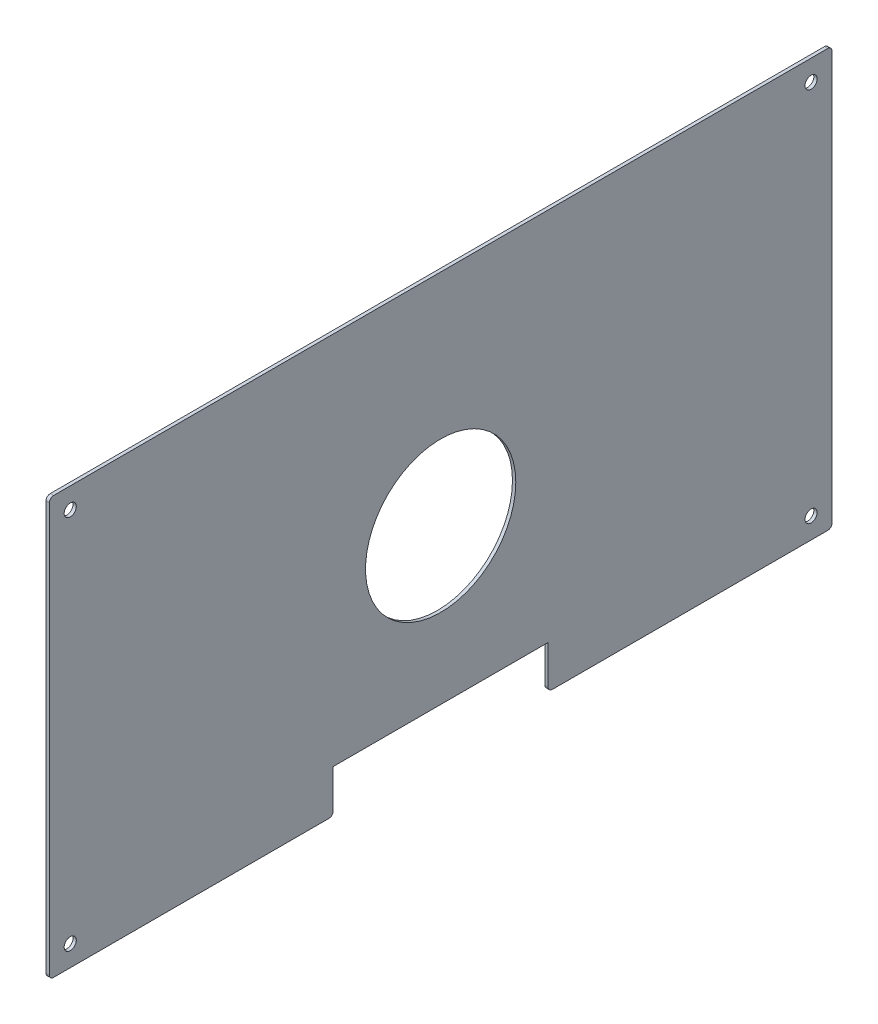
ISO-10303-21;
HEADER;
FILE_DESCRIPTION(('STEP AP214'),'2;1');
FILE_NAME('part.step','',(''),(''),'','','');
FILE_SCHEMA(('AUTOMOTIVE_DESIGN { 1 0 10303 214 1 1 1 1 }'));
ENDSEC;
DATA;
#1=APPLICATION_CONTEXT('core data for automotive mechanical design processes');
#2=APPLICATION_PROTOCOL_DEFINITION('international standard','automotive_design',2000,#1);
#3=PRODUCT_CONTEXT('',#1,'mechanical');
#4=PRODUCT('Part','Part','',(#3));
#5=PRODUCT_RELATED_PRODUCT_CATEGORY('part','',(#4));
#6=PRODUCT_DEFINITION_FORMATION('','',#4);
#7=PRODUCT_DEFINITION_CONTEXT('part definition',#1,'design');
#8=PRODUCT_DEFINITION('design','',#6,#7);
#9=PRODUCT_DEFINITION_SHAPE('','',#8);
#10=(LENGTH_UNIT() NAMED_UNIT(*) SI_UNIT(.MILLI.,.METRE.));
#11=(NAMED_UNIT(*) PLANE_ANGLE_UNIT() SI_UNIT($,.RADIAN.));
#12=(NAMED_UNIT(*) SI_UNIT($,.STERADIAN.) SOLID_ANGLE_UNIT());
#13=UNCERTAINTY_MEASURE_WITH_UNIT(LENGTH_MEASURE(1.E-05),#10,'distance_accuracy_value','');
#14=(GEOMETRIC_REPRESENTATION_CONTEXT(3) GLOBAL_UNCERTAINTY_ASSIGNED_CONTEXT((#13)) GLOBAL_UNIT_ASSIGNED_CONTEXT((#10,
#11,#12)) REPRESENTATION_CONTEXT('',''));
#15=CARTESIAN_POINT('',(0.,0.,0.));
#16=DIRECTION('',(0.,0.,1.));
#17=DIRECTION('',(1.,0.,0.));
#18=AXIS2_PLACEMENT_3D('',#15,#16,#17);
#19=CARTESIAN_POINT('',(-1.5875,-100.,187.5));
#20=DIRECTION('',(0.,-1.,0.));
#21=DIRECTION('',(0.,0.,-1.));
#22=AXIS2_PLACEMENT_3D('',#19,#20,#21);
#23=PLANE('',#22);
#24=DIRECTION('',(0.,0.,-1.));
#25=VECTOR('',#24,1.);
#26=CARTESIAN_POINT('',(-1.5875,-100.,187.5));
#27=LINE('',#26,#25);
#28=CARTESIAN_POINT('',(-1.5875,-100.,185.5));
#29=VERTEX_POINT('',#28);
#30=CARTESIAN_POINT('',(-1.5875,-100.,53.5));
#31=VERTEX_POINT('',#30);
#32=EDGE_CURVE('E203',#29,#31,#27,.T.);
#33=ORIENTED_EDGE('',*,*,#32,.T.);
#34=DIRECTION('',(1.,0.,0.));
#35=VECTOR('',#34,1.);
#36=CARTESIAN_POINT('',(0.,-100.,53.5));
#37=LINE('',#36,#35);
#38=CARTESIAN_POINT('',(0.,-100.,53.5));
#39=VERTEX_POINT('',#38);
#40=EDGE_CURVE('E260',#31,#39,#37,.T.);
#41=ORIENTED_EDGE('',*,*,#40,.T.);
#42=DIRECTION('',(0.,0.,-1.));
#43=VECTOR('',#42,1.);
#44=CARTESIAN_POINT('',(0.,-100.,187.5));
#45=LINE('',#44,#43);
#46=CARTESIAN_POINT('',(0.,-100.,185.5));
#47=VERTEX_POINT('',#46);
#48=EDGE_CURVE('E196',#47,#39,#45,.T.);
#49=ORIENTED_EDGE('',*,*,#48,.F.);
#50=DIRECTION('',(1.,0.,0.));
#51=VECTOR('',#50,1.);
#52=CARTESIAN_POINT('',(-1.5875,-100.,185.5));
#53=LINE('',#52,#51);
#54=EDGE_CURVE('E249',#47,#29,#53,.F.);
#55=ORIENTED_EDGE('',*,*,#54,.T.);
#56=EDGE_LOOP('',(#33,#41,#49,#55));
#57=FACE_BOUND('',#56,.T.);
#58=ADVANCED_FACE('F36',(#57),#23,.T.);
#59=CARTESIAN_POINT('',(-1.5875,-100.,-187.5));
#60=DIRECTION('',(0.,0.,-1.));
#61=DIRECTION('',(-1.,0.,0.));
#62=AXIS2_PLACEMENT_3D('',#59,#60,#61);
#63=PLANE('',#62);
#64=DIRECTION('',(0.,1.,0.));
#65=VECTOR('',#64,1.);
#66=CARTESIAN_POINT('',(-1.5875,-100.,-187.5));
#67=LINE('',#66,#65);
#68=CARTESIAN_POINT('',(-1.5875,-98.,-187.5));
#69=VERTEX_POINT('',#68);
#70=CARTESIAN_POINT('',(-1.5875,98.,-187.5));
#71=VERTEX_POINT('',#70);
#72=EDGE_CURVE('E192',#69,#71,#67,.T.);
#73=ORIENTED_EDGE('',*,*,#72,.T.);
#74=DIRECTION('',(1.,0.,0.));
#75=VECTOR('',#74,1.);
#76=CARTESIAN_POINT('',(-1.5875,98.,-187.5));
#77=LINE('',#76,#75);
#78=CARTESIAN_POINT('',(0.,98.,-187.5));
#79=VERTEX_POINT('',#78);
#80=EDGE_CURVE('E226',#71,#79,#77,.T.);
#81=ORIENTED_EDGE('',*,*,#80,.T.);
#82=DIRECTION('',(0.,1.,0.));
#83=VECTOR('',#82,1.);
#84=CARTESIAN_POINT('',(0.,-100.,-187.5));
#85=LINE('',#84,#83);
#86=CARTESIAN_POINT('',(0.,-98.,-187.5));
#87=VERTEX_POINT('',#86);
#88=EDGE_CURVE('E191',#87,#79,#85,.T.);
#89=ORIENTED_EDGE('',*,*,#88,.F.);
#90=DIRECTION('',(1.,0.,0.));
#91=VECTOR('',#90,1.);
#92=CARTESIAN_POINT('',(-1.5875,-98.,-187.5));
#93=LINE('',#92,#91);
#94=EDGE_CURVE('E221',#87,#69,#93,.F.);
#95=ORIENTED_EDGE('',*,*,#94,.T.);
#96=EDGE_LOOP('',(#73,#81,#89,#95));
#97=FACE_BOUND('',#96,.T.);
#98=ADVANCED_FACE('F297',(#97),#63,.T.);
#99=CARTESIAN_POINT('',(0.,-100.,-53.5));
#100=VERTEX_POINT('',#99);
#101=CARTESIAN_POINT('',(0.,-100.,-185.5));
#102=VERTEX_POINT('',#101);
#103=EDGE_CURVE('E215',#100,#102,#45,.T.);
#104=ORIENTED_EDGE('',*,*,#103,.F.);
#105=DIRECTION('',(1.,0.,0.));
#106=VECTOR('',#105,1.);
#107=CARTESIAN_POINT('',(-1.5875,-100.,-53.5));
#108=LINE('',#107,#106);
#109=CARTESIAN_POINT('',(-1.5875,-100.,-53.5));
#110=VERTEX_POINT('',#109);
#111=EDGE_CURVE('E256',#100,#110,#108,.F.);
#112=ORIENTED_EDGE('',*,*,#111,.T.);
#113=CARTESIAN_POINT('',(-1.5875,-100.,-185.5));
#114=VERTEX_POINT('',#113);
#115=EDGE_CURVE('E202',#110,#114,#27,.T.);
#116=ORIENTED_EDGE('',*,*,#115,.T.);
#117=DIRECTION('',(1.,0.,0.));
#118=VECTOR('',#117,1.);
#119=CARTESIAN_POINT('',(-1.5875,-100.,-185.5));
#120=LINE('',#119,#118);
#121=EDGE_CURVE('E206',#114,#102,#120,.T.);
#122=ORIENTED_EDGE('',*,*,#121,.T.);
#123=EDGE_LOOP('',(#104,#112,#116,#122));
#124=FACE_BOUND('',#123,.T.);
#125=ADVANCED_FACE('F308',(#124),#23,.T.);
#126=CARTESIAN_POINT('',(-1.5875,-100.,187.5));
#127=DIRECTION('',(0.,0.,1.));
#128=DIRECTION('',(1.,0.,0.));
#129=AXIS2_PLACEMENT_3D('',#126,#127,#128);
#130=PLANE('',#129);
#131=DIRECTION('',(0.,-1.,0.));
#132=VECTOR('',#131,1.);
#133=CARTESIAN_POINT('',(-1.5875,-100.,187.5));
#134=LINE('',#133,#132);
#135=CARTESIAN_POINT('',(-1.5875,98.,187.5));
#136=VERTEX_POINT('',#135);
#137=CARTESIAN_POINT('',(-1.5875,-98.,187.5));
#138=VERTEX_POINT('',#137);
#139=EDGE_CURVE('E199',#136,#138,#134,.T.);
#140=ORIENTED_EDGE('',*,*,#139,.T.);
#141=DIRECTION('',(1.,0.,0.));
#142=VECTOR('',#141,1.);
#143=CARTESIAN_POINT('',(-1.5875,-98.,187.5));
#144=LINE('',#143,#142);
#145=CARTESIAN_POINT('',(0.,-98.,187.5));
#146=VERTEX_POINT('',#145);
#147=EDGE_CURVE('E244',#138,#146,#144,.T.);
#148=ORIENTED_EDGE('',*,*,#147,.T.);
#149=DIRECTION('',(0.,-1.,0.));
#150=VECTOR('',#149,1.);
#151=CARTESIAN_POINT('',(0.,-100.,187.5));
#152=LINE('',#151,#150);
#153=CARTESIAN_POINT('',(0.,98.,187.5));
#154=VERTEX_POINT('',#153);
#155=EDGE_CURVE('E212',#154,#146,#152,.T.);
#156=ORIENTED_EDGE('',*,*,#155,.F.);
#157=DIRECTION('',(1.,0.,0.));
#158=VECTOR('',#157,1.);
#159=CARTESIAN_POINT('',(-1.5875,98.,187.5));
#160=LINE('',#159,#158);
#161=EDGE_CURVE('E240',#154,#136,#160,.F.);
#162=ORIENTED_EDGE('',*,*,#161,.T.);
#163=EDGE_LOOP('',(#140,#148,#156,#162));
#164=FACE_BOUND('',#163,.T.);
#165=ADVANCED_FACE('F276',(#164),#130,.T.);
#166=CARTESIAN_POINT('',(-1.5875,100.,187.5));
#167=DIRECTION('',(0.,1.,0.));
#168=DIRECTION('',(0.,0.,1.));
#169=AXIS2_PLACEMENT_3D('',#166,#167,#168);
#170=PLANE('',#169);
#171=DIRECTION('',(0.,0.,1.));
#172=VECTOR('',#171,1.);
#173=CARTESIAN_POINT('',(-1.5875,100.,187.5));
#174=LINE('',#173,#172);
#175=CARTESIAN_POINT('',(-1.5875,100.,-185.5));
#176=VERTEX_POINT('',#175);
#177=CARTESIAN_POINT('',(-1.5875,100.,185.5));
#178=VERTEX_POINT('',#177);
#179=EDGE_CURVE('E195',#176,#178,#174,.T.);
#180=ORIENTED_EDGE('',*,*,#179,.T.);
#181=DIRECTION('',(1.,0.,0.));
#182=VECTOR('',#181,1.);
#183=CARTESIAN_POINT('',(-1.5875,100.,185.5));
#184=LINE('',#183,#182);
#185=CARTESIAN_POINT('',(0.,100.,185.5));
#186=VERTEX_POINT('',#185);
#187=EDGE_CURVE('E235',#178,#186,#184,.T.);
#188=ORIENTED_EDGE('',*,*,#187,.T.);
#189=DIRECTION('',(0.,0.,1.));
#190=VECTOR('',#189,1.);
#191=CARTESIAN_POINT('',(0.,100.,187.5));
#192=LINE('',#191,#190);
#193=CARTESIAN_POINT('',(0.,100.,-185.5));
#194=VERTEX_POINT('',#193);
#195=EDGE_CURVE('E209',#194,#186,#192,.T.);
#196=ORIENTED_EDGE('',*,*,#195,.F.);
#197=DIRECTION('',(1.,0.,0.));
#198=VECTOR('',#197,1.);
#199=CARTESIAN_POINT('',(-1.5875,100.,-185.5));
#200=LINE('',#199,#198);
#201=EDGE_CURVE('E231',#194,#176,#200,.F.);
#202=ORIENTED_EDGE('',*,*,#201,.T.);
#203=EDGE_LOOP('',(#180,#188,#196,#202));
#204=FACE_BOUND('',#203,.T.);
#205=ADVANCED_FACE('F289',(#204),#170,.T.);
#206=CARTESIAN_POINT('',(-1.5875,0.,0.));
#207=DIRECTION('',(-1.,0.,0.));
#208=DIRECTION('',(0.,0.,1.));
#209=AXIS2_PLACEMENT_3D('',#206,#207,#208);
#210=PLANE('',#209);
#211=CARTESIAN_POINT('',(-1.5875,-5.28,0.));
#212=DIRECTION('',(-1.,0.,0.));
#213=DIRECTION('',(0.,0.,1.));
#214=AXIS2_PLACEMENT_3D('',#211,#212,#213);
#215=CIRCLE('',#214,36.);
#216=CARTESIAN_POINT('',(-1.5875,-5.28,36.));
#217=VERTEX_POINT('',#216);
#218=EDGE_CURVE('E399',#217,#217,#215,.T.);
#219=ORIENTED_EDGE('',*,*,#218,.F.);
#220=EDGE_LOOP('',(#219));
#221=FACE_BOUND('',#220,.T.);
#222=DIRECTION('',(0.,1.,0.));
#223=VECTOR('',#222,1.);
#224=CARTESIAN_POINT('',(-1.5875,0.,51.5));
#225=LINE('',#224,#223);
#226=CARTESIAN_POINT('',(-1.5875,-98.,51.5));
#227=VERTEX_POINT('',#226);
#228=CARTESIAN_POINT('',(-1.5875,-79.5,51.5));
#229=VERTEX_POINT('',#228);
#230=EDGE_CURVE('E165',#227,#229,#225,.T.);
#231=ORIENTED_EDGE('',*,*,#230,.F.);
#232=CARTESIAN_POINT('',(-1.5875,-98.,53.5));
#233=DIRECTION('',(-1.,0.,0.));
#234=DIRECTION('',(0.,0.,1.));
#235=AXIS2_PLACEMENT_3D('',#232,#233,#234);
#236=CIRCLE('',#235,2.);
#237=EDGE_CURVE('E11',#227,#31,#236,.T.);
#238=ORIENTED_EDGE('',*,*,#237,.T.);
#239=ORIENTED_EDGE('',*,*,#32,.F.);
#240=CARTESIAN_POINT('',(-1.5875,-98.,185.5));
#241=DIRECTION('',(-1.,0.,0.));
#242=DIRECTION('',(0.,0.,1.));
#243=AXIS2_PLACEMENT_3D('',#240,#241,#242);
#244=CIRCLE('',#243,2.);
#245=EDGE_CURVE('E251',#29,#138,#244,.T.);
#246=ORIENTED_EDGE('',*,*,#245,.T.);
#247=ORIENTED_EDGE('',*,*,#139,.F.);
#248=CARTESIAN_POINT('',(-1.5875,98.,185.5));
#249=DIRECTION('',(-1.,0.,0.));
#250=DIRECTION('',(0.,0.,1.));
#251=AXIS2_PLACEMENT_3D('',#248,#249,#250);
#252=CIRCLE('',#251,2.);
#253=EDGE_CURVE('E242',#136,#178,#252,.T.);
#254=ORIENTED_EDGE('',*,*,#253,.T.);
#255=ORIENTED_EDGE('',*,*,#179,.F.);
#256=CARTESIAN_POINT('',(-1.5875,98.,-185.5));
#257=DIRECTION('',(-1.,0.,0.));
#258=DIRECTION('',(0.,0.,1.));
#259=AXIS2_PLACEMENT_3D('',#256,#257,#258);
#260=CIRCLE('',#259,2.);
#261=EDGE_CURVE('E233',#176,#71,#260,.T.);
#262=ORIENTED_EDGE('',*,*,#261,.T.);
#263=ORIENTED_EDGE('',*,*,#72,.F.);
#264=CARTESIAN_POINT('',(-1.5875,-98.,-185.5));
#265=DIRECTION('',(-1.,0.,0.));
#266=DIRECTION('',(0.,0.,1.));
#267=AXIS2_PLACEMENT_3D('',#264,#265,#266);
#268=CIRCLE('',#267,2.);
#269=EDGE_CURVE('E223',#69,#114,#268,.T.);
#270=ORIENTED_EDGE('',*,*,#269,.T.);
#271=ORIENTED_EDGE('',*,*,#115,.F.);
#272=CARTESIAN_POINT('',(-1.5875,-98.,-53.5));
#273=DIRECTION('',(-1.,0.,0.));
#274=DIRECTION('',(0.,0.,1.));
#275=AXIS2_PLACEMENT_3D('',#272,#273,#274);
#276=CIRCLE('',#275,2.);
#277=CARTESIAN_POINT('',(-1.5875,-98.,-51.5));
#278=VERTEX_POINT('',#277);
#279=EDGE_CURVE('E258',#110,#278,#276,.T.);
#280=ORIENTED_EDGE('',*,*,#279,.T.);
#281=DIRECTION('',(0.,-1.,0.));
#282=VECTOR('',#281,1.);
#283=CARTESIAN_POINT('',(-1.5875,0.,-51.5));
#284=LINE('',#283,#282);
#285=CARTESIAN_POINT('',(-1.5875,-79.5,-51.5));
#286=VERTEX_POINT('',#285);
#287=EDGE_CURVE('E161',#286,#278,#284,.T.);
#288=ORIENTED_EDGE('',*,*,#287,.F.);
#289=DIRECTION('',(0.,0.,-1.));
#290=VECTOR('',#289,1.);
#291=CARTESIAN_POINT('',(-1.5875,-79.5,0.));
#292=LINE('',#291,#290);
#293=EDGE_CURVE('E154',#229,#286,#292,.T.);
#294=ORIENTED_EDGE('',*,*,#293,.F.);
#295=EDGE_LOOP('',(#231,#238,#239,#246,#247,#254,#255,#262,#263,#270,#271,#280,#288,#294));
#296=FACE_BOUND('',#295,.T.);
#297=CARTESIAN_POINT('',(-1.5875,-90.,177.5));
#298=DIRECTION('',(-1.,0.,0.));
#299=DIRECTION('',(0.,0.,1.));
#300=AXIS2_PLACEMENT_3D('',#297,#298,#299);
#301=CIRCLE('',#300,2.9);
#302=CARTESIAN_POINT('',(-1.5875,-90.,180.4));
#303=VERTEX_POINT('',#302);
#304=EDGE_CURVE('E167',#303,#303,#301,.T.);
#305=ORIENTED_EDGE('',*,*,#304,.F.);
#306=EDGE_LOOP('',(#305));
#307=FACE_BOUND('',#306,.T.);
#308=CARTESIAN_POINT('',(-1.5875,-90.,-177.5));
#309=DIRECTION('',(-1.,0.,0.));
#310=DIRECTION('',(0.,0.,1.));
#311=AXIS2_PLACEMENT_3D('',#308,#309,#310);
#312=CIRCLE('',#311,2.9);
#313=CARTESIAN_POINT('',(-1.5875,-90.,-174.6));
#314=VERTEX_POINT('',#313);
#315=EDGE_CURVE('E173',#314,#314,#312,.T.);
#316=ORIENTED_EDGE('',*,*,#315,.F.);
#317=EDGE_LOOP('',(#316));
#318=FACE_BOUND('',#317,.T.);
#319=CARTESIAN_POINT('',(-1.5875,90.,-177.5));
#320=DIRECTION('',(-1.,0.,0.));
#321=DIRECTION('',(0.,0.,1.));
#322=AXIS2_PLACEMENT_3D('',#319,#320,#321);
#323=CIRCLE('',#322,2.9);
#324=CARTESIAN_POINT('',(-1.5875,90.,-174.6));
#325=VERTEX_POINT('',#324);
#326=EDGE_CURVE('E179',#325,#325,#323,.T.);
#327=ORIENTED_EDGE('',*,*,#326,.F.);
#328=EDGE_LOOP('',(#327));
#329=FACE_BOUND('',#328,.T.);
#330=CARTESIAN_POINT('',(-1.5875,90.,177.5));
#331=DIRECTION('',(-1.,0.,0.));
#332=DIRECTION('',(0.,0.,1.));
#333=AXIS2_PLACEMENT_3D('',#330,#331,#332);
#334=CIRCLE('',#333,2.9);
#335=CARTESIAN_POINT('',(-1.5875,90.,180.4));
#336=VERTEX_POINT('',#335);
#337=EDGE_CURVE('E185',#336,#336,#334,.T.);
#338=ORIENTED_EDGE('',*,*,#337,.F.);
#339=EDGE_LOOP('',(#338));
#340=FACE_BOUND('',#339,.T.);
#341=ADVANCED_FACE('F281',(#221,#296,#307,#318,#329,#340),#210,.T.);
#342=CARTESIAN_POINT('',(0.,0.,0.));
#343=DIRECTION('',(-1.,0.,0.));
#344=DIRECTION('',(0.,0.,1.));
#345=AXIS2_PLACEMENT_3D('',#342,#343,#344);
#346=PLANE('',#345);
#347=CARTESIAN_POINT('',(0.,-5.28,0.));
#348=DIRECTION('',(1.,0.,0.));
#349=DIRECTION('',(0.,0.,-1.));
#350=AXIS2_PLACEMENT_3D('',#347,#348,#349);
#351=CIRCLE('',#350,36.);
#352=CARTESIAN_POINT('',(0.,-5.28,-36.));
#353=VERTEX_POINT('',#352);
#354=EDGE_CURVE('E379',#353,#353,#351,.T.);
#355=ORIENTED_EDGE('',*,*,#354,.F.);
#356=EDGE_LOOP('',(#355));
#357=FACE_BOUND('',#356,.T.);
#358=CARTESIAN_POINT('',(0.,-90.,177.5));
#359=DIRECTION('',(-1.,0.,0.));
#360=DIRECTION('',(0.,0.,1.));
#361=AXIS2_PLACEMENT_3D('',#358,#359,#360);
#362=CIRCLE('',#361,2.9);
#363=CARTESIAN_POINT('',(0.,-90.,180.4));
#364=VERTEX_POINT('',#363);
#365=EDGE_CURVE('E170',#364,#364,#362,.T.);
#366=ORIENTED_EDGE('',*,*,#365,.T.);
#367=EDGE_LOOP('',(#366));
#368=FACE_BOUND('',#367,.T.);
#369=CARTESIAN_POINT('',(0.,-90.,-177.5));
#370=DIRECTION('',(-1.,0.,0.));
#371=DIRECTION('',(0.,0.,1.));
#372=AXIS2_PLACEMENT_3D('',#369,#370,#371);
#373=CIRCLE('',#372,2.9);
#374=CARTESIAN_POINT('',(0.,-90.,-174.6));
#375=VERTEX_POINT('',#374);
#376=EDGE_CURVE('E176',#375,#375,#373,.T.);
#377=ORIENTED_EDGE('',*,*,#376,.T.);
#378=EDGE_LOOP('',(#377));
#379=FACE_BOUND('',#378,.T.);
#380=CARTESIAN_POINT('',(0.,90.,-177.5));
#381=DIRECTION('',(-1.,0.,0.));
#382=DIRECTION('',(0.,0.,1.));
#383=AXIS2_PLACEMENT_3D('',#380,#381,#382);
#384=CIRCLE('',#383,2.9);
#385=CARTESIAN_POINT('',(0.,90.,-174.6));
#386=VERTEX_POINT('',#385);
#387=EDGE_CURVE('E182',#386,#386,#384,.T.);
#388=ORIENTED_EDGE('',*,*,#387,.T.);
#389=EDGE_LOOP('',(#388));
#390=FACE_BOUND('',#389,.T.);
#391=CARTESIAN_POINT('',(0.,90.,177.5));
#392=DIRECTION('',(-1.,0.,0.));
#393=DIRECTION('',(0.,0.,1.));
#394=AXIS2_PLACEMENT_3D('',#391,#392,#393);
#395=CIRCLE('',#394,2.9);
#396=CARTESIAN_POINT('',(0.,90.,180.4));
#397=VERTEX_POINT('',#396);
#398=EDGE_CURVE('E188',#397,#397,#395,.T.);
#399=ORIENTED_EDGE('',*,*,#398,.T.);
#400=EDGE_LOOP('',(#399));
#401=FACE_BOUND('',#400,.T.);
#402=ORIENTED_EDGE('',*,*,#48,.T.);
#403=CARTESIAN_POINT('',(0.,-98.,53.5));
#404=DIRECTION('',(-1.,0.,0.));
#405=DIRECTION('',(0.,0.,1.));
#406=AXIS2_PLACEMENT_3D('',#403,#404,#405);
#407=CIRCLE('',#406,2.);
#408=CARTESIAN_POINT('',(0.,-98.,51.5));
#409=VERTEX_POINT('',#408);
#410=EDGE_CURVE('E58',#39,#409,#407,.F.);
#411=ORIENTED_EDGE('',*,*,#410,.T.);
#412=DIRECTION('',(0.,-1.,0.));
#413=VECTOR('',#412,1.);
#414=CARTESIAN_POINT('',(0.,-79.5,51.5));
#415=LINE('',#414,#413);
#416=CARTESIAN_POINT('',(0.,-79.5,51.5));
#417=VERTEX_POINT('',#416);
#418=EDGE_CURVE('E147',#417,#409,#415,.T.);
#419=ORIENTED_EDGE('',*,*,#418,.F.);
#420=DIRECTION('',(0.,0.,1.));
#421=VECTOR('',#420,1.);
#422=CARTESIAN_POINT('',(0.,-79.5,-51.5));
#423=LINE('',#422,#421);
#424=CARTESIAN_POINT('',(0.,-79.5,-51.5));
#425=VERTEX_POINT('',#424);
#426=EDGE_CURVE('E146',#425,#417,#423,.T.);
#427=ORIENTED_EDGE('',*,*,#426,.F.);
#428=DIRECTION('',(0.,1.,0.));
#429=VECTOR('',#428,1.);
#430=CARTESIAN_POINT('',(0.,-100.,-51.5));
#431=LINE('',#430,#429);
#432=CARTESIAN_POINT('',(0.,-98.,-51.5));
#433=VERTEX_POINT('',#432);
#434=EDGE_CURVE('E137',#433,#425,#431,.T.);
#435=ORIENTED_EDGE('',*,*,#434,.F.);
#436=CARTESIAN_POINT('',(0.,-98.,-53.5));
#437=DIRECTION('',(-1.,0.,0.));
#438=DIRECTION('',(0.,0.,1.));
#439=AXIS2_PLACEMENT_3D('',#436,#437,#438);
#440=CIRCLE('',#439,2.);
#441=EDGE_CURVE('E254',#433,#100,#440,.F.);
#442=ORIENTED_EDGE('',*,*,#441,.T.);
#443=ORIENTED_EDGE('',*,*,#103,.T.);
#444=CARTESIAN_POINT('',(0.,-98.,-185.5));
#445=DIRECTION('',(-1.,0.,0.));
#446=DIRECTION('',(0.,0.,1.));
#447=AXIS2_PLACEMENT_3D('',#444,#445,#446);
#448=CIRCLE('',#447,2.);
#449=EDGE_CURVE('E219',#102,#87,#448,.F.);
#450=ORIENTED_EDGE('',*,*,#449,.T.);
#451=ORIENTED_EDGE('',*,*,#88,.T.);
#452=CARTESIAN_POINT('',(0.,98.,-185.5));
#453=DIRECTION('',(-1.,0.,0.));
#454=DIRECTION('',(0.,0.,1.));
#455=AXIS2_PLACEMENT_3D('',#452,#453,#454);
#456=CIRCLE('',#455,2.);
#457=EDGE_CURVE('E229',#79,#194,#456,.F.);
#458=ORIENTED_EDGE('',*,*,#457,.T.);
#459=ORIENTED_EDGE('',*,*,#195,.T.);
#460=CARTESIAN_POINT('',(0.,98.,185.5));
#461=DIRECTION('',(-1.,0.,0.));
#462=DIRECTION('',(0.,0.,1.));
#463=AXIS2_PLACEMENT_3D('',#460,#461,#462);
#464=CIRCLE('',#463,2.);
#465=EDGE_CURVE('E238',#186,#154,#464,.F.);
#466=ORIENTED_EDGE('',*,*,#465,.T.);
#467=ORIENTED_EDGE('',*,*,#155,.T.);
#468=CARTESIAN_POINT('',(0.,-98.,185.5));
#469=DIRECTION('',(-1.,0.,0.));
#470=DIRECTION('',(0.,0.,1.));
#471=AXIS2_PLACEMENT_3D('',#468,#469,#470);
#472=CIRCLE('',#471,2.);
#473=EDGE_CURVE('E247',#146,#47,#472,.F.);
#474=ORIENTED_EDGE('',*,*,#473,.T.);
#475=EDGE_LOOP('',(#402,#411,#419,#427,#435,#442,#443,#450,#451,#458,#459,#466,#467,#474));
#476=FACE_BOUND('',#475,.T.);
#477=ADVANCED_FACE('F157',(#357,#368,#379,#390,#401,#476),#346,.F.);
#478=CARTESIAN_POINT('',(-1.5875,90.,177.5));
#479=DIRECTION('',(-1.,0.,0.));
#480=DIRECTION('',(0.,0.,1.));
#481=AXIS2_PLACEMENT_3D('',#478,#479,#480);
#482=CYLINDRICAL_SURFACE('',#481,2.9);
#483=ORIENTED_EDGE('',*,*,#398,.F.);
#484=EDGE_LOOP('',(#483));
#485=FACE_BOUND('',#484,.T.);
#486=ORIENTED_EDGE('',*,*,#337,.T.);
#487=EDGE_LOOP('',(#486));
#488=FACE_BOUND('',#487,.T.);
#489=ADVANCED_FACE('F365',(#485,#488),#482,.F.);
#490=CARTESIAN_POINT('',(-1.5875,90.,-177.5));
#491=DIRECTION('',(-1.,0.,0.));
#492=DIRECTION('',(0.,0.,1.));
#493=AXIS2_PLACEMENT_3D('',#490,#491,#492);
#494=CYLINDRICAL_SURFACE('',#493,2.9);
#495=ORIENTED_EDGE('',*,*,#387,.F.);
#496=EDGE_LOOP('',(#495));
#497=FACE_BOUND('',#496,.T.);
#498=ORIENTED_EDGE('',*,*,#326,.T.);
#499=EDGE_LOOP('',(#498));
#500=FACE_BOUND('',#499,.T.);
#501=ADVANCED_FACE('F361',(#497,#500),#494,.F.);
#502=CARTESIAN_POINT('',(-1.5875,-90.,-177.5));
#503=DIRECTION('',(-1.,0.,0.));
#504=DIRECTION('',(0.,0.,1.));
#505=AXIS2_PLACEMENT_3D('',#502,#503,#504);
#506=CYLINDRICAL_SURFACE('',#505,2.9);
#507=ORIENTED_EDGE('',*,*,#376,.F.);
#508=EDGE_LOOP('',(#507));
#509=FACE_BOUND('',#508,.T.);
#510=ORIENTED_EDGE('',*,*,#315,.T.);
#511=EDGE_LOOP('',(#510));
#512=FACE_BOUND('',#511,.T.);
#513=ADVANCED_FACE('F357',(#509,#512),#506,.F.);
#514=CARTESIAN_POINT('',(-1.5875,-90.,177.5));
#515=DIRECTION('',(-1.,0.,0.));
#516=DIRECTION('',(0.,0.,1.));
#517=AXIS2_PLACEMENT_3D('',#514,#515,#516);
#518=CYLINDRICAL_SURFACE('',#517,2.9);
#519=ORIENTED_EDGE('',*,*,#365,.F.);
#520=EDGE_LOOP('',(#519));
#521=FACE_BOUND('',#520,.T.);
#522=ORIENTED_EDGE('',*,*,#304,.T.);
#523=EDGE_LOOP('',(#522));
#524=FACE_BOUND('',#523,.T.);
#525=ADVANCED_FACE('F340',(#521,#524),#518,.F.);
#526=CARTESIAN_POINT('',(-1.5875,-98.,-185.5));
#527=DIRECTION('',(1.,0.,0.));
#528=DIRECTION('',(0.,0.,-1.));
#529=AXIS2_PLACEMENT_3D('',#526,#527,#528);
#530=CYLINDRICAL_SURFACE('',#529,2.);
#531=ORIENTED_EDGE('',*,*,#269,.F.);
#532=ORIENTED_EDGE('',*,*,#94,.F.);
#533=ORIENTED_EDGE('',*,*,#449,.F.);
#534=ORIENTED_EDGE('',*,*,#121,.F.);
#535=EDGE_LOOP('',(#531,#532,#533,#534));
#536=FACE_BOUND('',#535,.T.);
#537=ADVANCED_FACE('F304',(#536),#530,.T.);
#538=CARTESIAN_POINT('',(-1.5875,98.,-185.5));
#539=DIRECTION('',(1.,0.,0.));
#540=DIRECTION('',(0.,0.,-1.));
#541=AXIS2_PLACEMENT_3D('',#538,#539,#540);
#542=CYLINDRICAL_SURFACE('',#541,2.);
#543=ORIENTED_EDGE('',*,*,#261,.F.);
#544=ORIENTED_EDGE('',*,*,#201,.F.);
#545=ORIENTED_EDGE('',*,*,#457,.F.);
#546=ORIENTED_EDGE('',*,*,#80,.F.);
#547=EDGE_LOOP('',(#543,#544,#545,#546));
#548=FACE_BOUND('',#547,.T.);
#549=ADVANCED_FACE('F295',(#548),#542,.T.);
#550=CARTESIAN_POINT('',(-1.5875,98.,185.5));
#551=DIRECTION('',(1.,0.,0.));
#552=DIRECTION('',(0.,0.,-1.));
#553=AXIS2_PLACEMENT_3D('',#550,#551,#552);
#554=CYLINDRICAL_SURFACE('',#553,2.);
#555=ORIENTED_EDGE('',*,*,#253,.F.);
#556=ORIENTED_EDGE('',*,*,#161,.F.);
#557=ORIENTED_EDGE('',*,*,#465,.F.);
#558=ORIENTED_EDGE('',*,*,#187,.F.);
#559=EDGE_LOOP('',(#555,#556,#557,#558));
#560=FACE_BOUND('',#559,.T.);
#561=ADVANCED_FACE('F286',(#560),#554,.T.);
#562=CARTESIAN_POINT('',(-1.5875,-98.,185.5));
#563=DIRECTION('',(1.,0.,0.));
#564=DIRECTION('',(0.,0.,-1.));
#565=AXIS2_PLACEMENT_3D('',#562,#563,#564);
#566=CYLINDRICAL_SURFACE('',#565,2.);
#567=ORIENTED_EDGE('',*,*,#245,.F.);
#568=ORIENTED_EDGE('',*,*,#54,.F.);
#569=ORIENTED_EDGE('',*,*,#473,.F.);
#570=ORIENTED_EDGE('',*,*,#147,.F.);
#571=EDGE_LOOP('',(#567,#568,#569,#570));
#572=FACE_BOUND('',#571,.T.);
#573=ADVANCED_FACE('F274',(#572),#566,.T.);
#574=CARTESIAN_POINT('',(-10.,-79.5,51.5));
#575=DIRECTION('',(0.,0.,1.));
#576=DIRECTION('',(0.,-1.,0.));
#577=AXIS2_PLACEMENT_3D('',#574,#575,#576);
#578=PLANE('',#577);
#579=ORIENTED_EDGE('',*,*,#418,.T.);
#580=DIRECTION('',(1.,0.,0.));
#581=VECTOR('',#580,1.);
#582=CARTESIAN_POINT('',(-1.5875,-98.,51.5));
#583=LINE('',#582,#581);
#584=EDGE_CURVE('E44',#409,#227,#583,.F.);
#585=ORIENTED_EDGE('',*,*,#584,.T.);
#586=ORIENTED_EDGE('',*,*,#230,.T.);
#587=DIRECTION('',(1.,0.,0.));
#588=VECTOR('',#587,1.);
#589=CARTESIAN_POINT('',(-10.,-79.5,51.5));
#590=LINE('',#589,#588);
#591=EDGE_CURVE('E155',#229,#417,#590,.T.);
#592=ORIENTED_EDGE('',*,*,#591,.T.);
#593=EDGE_LOOP('',(#579,#585,#586,#592));
#594=FACE_BOUND('',#593,.T.);
#595=ADVANCED_FACE('F345',(#594),#578,.F.);
#596=CARTESIAN_POINT('',(-10.,-79.5,-51.5));
#597=DIRECTION('',(0.,1.,0.));
#598=DIRECTION('',(0.,0.,1.));
#599=AXIS2_PLACEMENT_3D('',#596,#597,#598);
#600=PLANE('',#599);
#601=ORIENTED_EDGE('',*,*,#293,.T.);
#602=DIRECTION('',(1.,0.,0.));
#603=VECTOR('',#602,1.);
#604=CARTESIAN_POINT('',(-10.,-79.5,-51.5));
#605=LINE('',#604,#603);
#606=EDGE_CURVE('E141',#286,#425,#605,.T.);
#607=ORIENTED_EDGE('',*,*,#606,.T.);
#608=ORIENTED_EDGE('',*,*,#426,.T.);
#609=ORIENTED_EDGE('',*,*,#591,.F.);
#610=EDGE_LOOP('',(#601,#607,#608,#609));
#611=FACE_BOUND('',#610,.T.);
#612=ADVANCED_FACE('F151',(#611),#600,.F.);
#613=CARTESIAN_POINT('',(-10.,-100.,-51.5));
#614=DIRECTION('',(0.,0.,-1.));
#615=DIRECTION('',(0.,1.,0.));
#616=AXIS2_PLACEMENT_3D('',#613,#614,#615);
#617=PLANE('',#616);
#618=ORIENTED_EDGE('',*,*,#287,.T.);
#619=DIRECTION('',(1.,0.,0.));
#620=VECTOR('',#619,1.);
#621=CARTESIAN_POINT('',(0.,-98.,-51.5));
#622=LINE('',#621,#620);
#623=EDGE_CURVE('E144',#278,#433,#622,.T.);
#624=ORIENTED_EDGE('',*,*,#623,.T.);
#625=ORIENTED_EDGE('',*,*,#434,.T.);
#626=ORIENTED_EDGE('',*,*,#606,.F.);
#627=EDGE_LOOP('',(#618,#624,#625,#626));
#628=FACE_BOUND('',#627,.T.);
#629=ADVANCED_FACE('F140',(#628),#617,.F.);
#630=CARTESIAN_POINT('',(-10.,-98.,-53.5));
#631=DIRECTION('',(-1.,0.,0.));
#632=DIRECTION('',(0.,0.,1.));
#633=AXIS2_PLACEMENT_3D('',#630,#631,#632);
#634=CYLINDRICAL_SURFACE('',#633,2.);
#635=ORIENTED_EDGE('',*,*,#279,.F.);
#636=ORIENTED_EDGE('',*,*,#111,.F.);
#637=ORIENTED_EDGE('',*,*,#441,.F.);
#638=ORIENTED_EDGE('',*,*,#623,.F.);
#639=EDGE_LOOP('',(#635,#636,#637,#638));
#640=FACE_BOUND('',#639,.T.);
#641=ADVANCED_FACE('F312',(#640),#634,.T.);
#642=CARTESIAN_POINT('',(-1.5875,-98.,53.5));
#643=DIRECTION('',(-1.,0.,0.));
#644=DIRECTION('',(0.,0.,1.));
#645=AXIS2_PLACEMENT_3D('',#642,#643,#644);
#646=CYLINDRICAL_SURFACE('',#645,2.);
#647=ORIENTED_EDGE('',*,*,#237,.F.);
#648=ORIENTED_EDGE('',*,*,#584,.F.);
#649=ORIENTED_EDGE('',*,*,#410,.F.);
#650=ORIENTED_EDGE('',*,*,#40,.F.);
#651=EDGE_LOOP('',(#647,#648,#649,#650));
#652=FACE_BOUND('',#651,.T.);
#653=ADVANCED_FACE('F38',(#652),#646,.T.);
#654=CARTESIAN_POINT('',(-10.,-5.28,0.));
#655=DIRECTION('',(1.,0.,0.));
#656=DIRECTION('',(0.,0.,-1.));
#657=AXIS2_PLACEMENT_3D('',#654,#655,#656);
#658=CYLINDRICAL_SURFACE('',#657,36.);
#659=ORIENTED_EDGE('',*,*,#218,.T.);
#660=EDGE_LOOP('',(#659));
#661=FACE_BOUND('',#660,.T.);
#662=ORIENTED_EDGE('',*,*,#354,.T.);
#663=EDGE_LOOP('',(#662));
#664=FACE_BOUND('',#663,.T.);
#665=ADVANCED_FACE('F318',(#661,#664),#658,.F.);
#666=CLOSED_SHELL('',(#58,#98,#125,#165,#205,#341,#477,#489,#501,#513,#525,#537,#549,#561,#573,
#595,#612,#629,#641,#653,#665));
#667=MANIFOLD_SOLID_BREP('B2',#666);
#668=ADVANCED_BREP_SHAPE_REPRESENTATION('',(#18,#667),#14);
#669=SHAPE_DEFINITION_REPRESENTATION(#9,#668);
ENDSEC;
END-ISO-10303-21;
